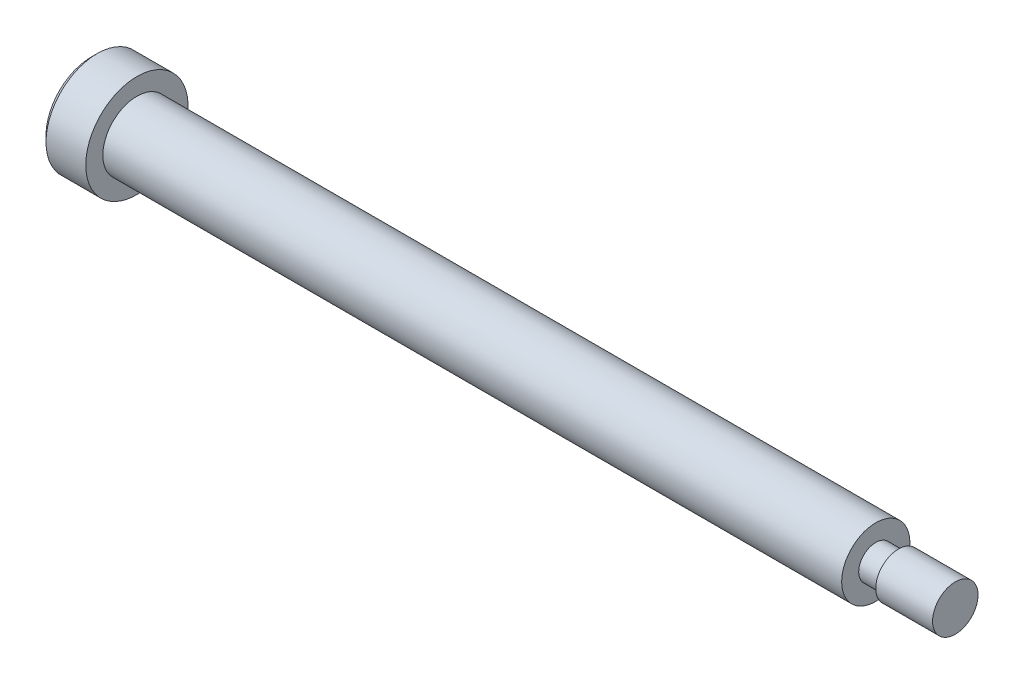
ISO-10303-21;
HEADER;
FILE_DESCRIPTION(('STEP AP214'),'2;1');
FILE_NAME('part.step','',(''),(''),'','','');
FILE_SCHEMA(('AUTOMOTIVE_DESIGN { 1 0 10303 214 1 1 1 1 }'));
ENDSEC;
DATA;
#1=APPLICATION_CONTEXT('core data for automotive mechanical design processes');
#2=APPLICATION_PROTOCOL_DEFINITION('international standard','automotive_design',2000,#1);
#3=PRODUCT_CONTEXT('',#1,'mechanical');
#4=PRODUCT('Part','Part','',(#3));
#5=PRODUCT_RELATED_PRODUCT_CATEGORY('part','',(#4));
#6=PRODUCT_DEFINITION_FORMATION('','',#4);
#7=PRODUCT_DEFINITION_CONTEXT('part definition',#1,'design');
#8=PRODUCT_DEFINITION('design','',#6,#7);
#9=PRODUCT_DEFINITION_SHAPE('','',#8);
#10=(LENGTH_UNIT() NAMED_UNIT(*) SI_UNIT(.MILLI.,.METRE.));
#11=(NAMED_UNIT(*) PLANE_ANGLE_UNIT() SI_UNIT($,.RADIAN.));
#12=(NAMED_UNIT(*) SI_UNIT($,.STERADIAN.) SOLID_ANGLE_UNIT());
#13=UNCERTAINTY_MEASURE_WITH_UNIT(LENGTH_MEASURE(1.E-05),#10,'distance_accuracy_value','');
#14=(GEOMETRIC_REPRESENTATION_CONTEXT(3) GLOBAL_UNCERTAINTY_ASSIGNED_CONTEXT((#13)) GLOBAL_UNIT_ASSIGNED_CONTEXT((#10,
#11,#12)) REPRESENTATION_CONTEXT('',''));
#15=CARTESIAN_POINT('',(0.,0.,0.));
#16=DIRECTION('',(0.,0.,1.));
#17=DIRECTION('',(1.,0.,0.));
#18=AXIS2_PLACEMENT_3D('',#15,#16,#17);
#19=CARTESIAN_POINT('',(0.,4.5,0.));
#20=DIRECTION('',(-1.,0.,0.));
#21=DIRECTION('',(0.,0.,1.));
#22=AXIS2_PLACEMENT_3D('',#19,#20,#21);
#23=PLANE('',#22);
#24=CARTESIAN_POINT('',(0.,0.,0.));
#25=DIRECTION('',(-1.,0.,0.));
#26=DIRECTION('',(0.,0.,1.));
#27=AXIS2_PLACEMENT_3D('',#24,#25,#26);
#28=CIRCLE('',#27,4.5);
#29=CARTESIAN_POINT('',(0.,0.,4.5));
#30=VERTEX_POINT('',#29);
#31=EDGE_CURVE('E158',#30,#30,#28,.T.);
#32=ORIENTED_EDGE('',*,*,#31,.F.);
#33=EDGE_LOOP('',(#32));
#34=FACE_BOUND('',#33,.T.);
#35=CARTESIAN_POINT('',(0.,0.,0.));
#36=DIRECTION('',(-1.,0.,0.));
#37=DIRECTION('',(0.,0.,1.));
#38=AXIS2_PLACEMENT_3D('',#35,#36,#37);
#39=CIRCLE('',#38,3.);
#40=CARTESIAN_POINT('',(0.,0.,3.));
#41=VERTEX_POINT('',#40);
#42=EDGE_CURVE('E135',#41,#41,#39,.T.);
#43=ORIENTED_EDGE('',*,*,#42,.T.);
#44=EDGE_LOOP('',(#43));
#45=FACE_BOUND('',#44,.T.);
#46=ADVANCED_FACE('F33',(#34,#45),#23,.F.);
#47=CARTESIAN_POINT('',(-15.4482466475727,0.,0.));
#48=DIRECTION('',(-1.,0.,0.));
#49=DIRECTION('',(0.,0.,1.));
#50=AXIS2_PLACEMENT_3D('',#47,#48,#49);
#51=CYLINDRICAL_SURFACE('',#50,4.5);
#52=CARTESIAN_POINT('',(-3.49999999999999,0.,0.));
#53=DIRECTION('',(1.,0.,0.));
#54=DIRECTION('',(0.,0.,-1.));
#55=AXIS2_PLACEMENT_3D('',#52,#53,#54);
#56=CIRCLE('',#55,4.5);
#57=CARTESIAN_POINT('',(-3.49999999999999,0.,-4.5));
#58=VERTEX_POINT('',#57);
#59=EDGE_CURVE('E11',#58,#58,#56,.T.);
#60=ORIENTED_EDGE('',*,*,#59,.T.);
#61=EDGE_LOOP('',(#60));
#62=FACE_BOUND('',#61,.T.);
#63=ORIENTED_EDGE('',*,*,#31,.T.);
#64=EDGE_LOOP('',(#63));
#65=FACE_BOUND('',#64,.T.);
#66=ADVANCED_FACE('F180',(#62,#65),#51,.T.);
#67=CARTESIAN_POINT('',(-4.,0.,0.));
#68=DIRECTION('',(1.,0.,0.));
#69=DIRECTION('',(0.,0.,-1.));
#70=AXIS2_PLACEMENT_3D('',#67,#68,#69);
#71=PLANE('',#70);
#72=DIRECTION('',(0.,-0.5,-0.866025403784439));
#73=VECTOR('',#72,1.);
#74=CARTESIAN_POINT('',(-4.,1.73205080756888,0.));
#75=LINE('',#74,#73);
#76=CARTESIAN_POINT('',(-4.,1.73205080756888,0.));
#77=VERTEX_POINT('',#76);
#78=CARTESIAN_POINT('',(-4.,0.866025403784438,-1.5));
#79=VERTEX_POINT('',#78);
#80=EDGE_CURVE('E122',#77,#79,#75,.T.);
#81=ORIENTED_EDGE('',*,*,#80,.F.);
#82=DIRECTION('',(0.,0.5,-0.866025403784439));
#83=VECTOR('',#82,1.);
#84=CARTESIAN_POINT('',(-4.,0.86602540378444,1.5));
#85=LINE('',#84,#83);
#86=CARTESIAN_POINT('',(-4.,0.86602540378444,1.5));
#87=VERTEX_POINT('',#86);
#88=EDGE_CURVE('E48',#87,#77,#85,.T.);
#89=ORIENTED_EDGE('',*,*,#88,.F.);
#90=DIRECTION('',(0.,1.,0.));
#91=VECTOR('',#90,1.);
#92=CARTESIAN_POINT('',(-4.,-0.866025403784439,1.5));
#93=LINE('',#92,#91);
#94=CARTESIAN_POINT('',(-4.,-0.866025403784439,1.5));
#95=VERTEX_POINT('',#94);
#96=EDGE_CURVE('E131',#95,#87,#93,.T.);
#97=ORIENTED_EDGE('',*,*,#96,.F.);
#98=DIRECTION('',(0.,0.5,0.866025403784438));
#99=VECTOR('',#98,1.);
#100=CARTESIAN_POINT('',(-4.,-1.73205080756888,0.));
#101=LINE('',#100,#99);
#102=CARTESIAN_POINT('',(-4.,-1.73205080756888,0.));
#103=VERTEX_POINT('',#102);
#104=EDGE_CURVE('E129',#103,#95,#101,.T.);
#105=ORIENTED_EDGE('',*,*,#104,.F.);
#106=DIRECTION('',(0.,-0.5,0.866025403784439));
#107=VECTOR('',#106,1.);
#108=CARTESIAN_POINT('',(-4.,-0.866025403784439,-1.5));
#109=LINE('',#108,#107);
#110=CARTESIAN_POINT('',(-4.,-0.866025403784439,-1.5));
#111=VERTEX_POINT('',#110);
#112=EDGE_CURVE('E96',#111,#103,#109,.T.);
#113=ORIENTED_EDGE('',*,*,#112,.F.);
#114=DIRECTION('',(0.,-1.,0.));
#115=VECTOR('',#114,1.);
#116=CARTESIAN_POINT('',(-4.,0.866025403784438,-1.5));
#117=LINE('',#116,#115);
#118=EDGE_CURVE('E125',#79,#111,#117,.T.);
#119=ORIENTED_EDGE('',*,*,#118,.F.);
#120=EDGE_LOOP('',(#81,#89,#97,#105,#113,#119));
#121=FACE_BOUND('',#120,.T.);
#122=CARTESIAN_POINT('',(-4.,0.,0.));
#123=DIRECTION('',(1.,0.,0.));
#124=DIRECTION('',(0.,0.,-1.));
#125=AXIS2_PLACEMENT_3D('',#122,#123,#124);
#126=CIRCLE('',#125,3.99999999999999);
#127=CARTESIAN_POINT('',(-4.,0.,-3.99999999999999));
#128=VERTEX_POINT('',#127);
#129=EDGE_CURVE('E41',#128,#128,#126,.F.);
#130=ORIENTED_EDGE('',*,*,#129,.T.);
#131=EDGE_LOOP('',(#130));
#132=FACE_BOUND('',#131,.T.);
#133=ADVANCED_FACE('F163',(#121,#132),#71,.F.);
#134=CARTESIAN_POINT('',(72.,2.,0.));
#135=DIRECTION('',(-1.,0.,0.));
#136=DIRECTION('',(0.,0.,1.));
#137=AXIS2_PLACEMENT_3D('',#134,#135,#136);
#138=PLANE('',#137);
#139=CARTESIAN_POINT('',(72.,0.,0.));
#140=DIRECTION('',(-1.,0.,0.));
#141=DIRECTION('',(0.,0.,1.));
#142=AXIS2_PLACEMENT_3D('',#139,#140,#141);
#143=CIRCLE('',#142,2.);
#144=CARTESIAN_POINT('',(72.,0.,2.));
#145=VERTEX_POINT('',#144);
#146=EDGE_CURVE('E155',#145,#145,#143,.T.);
#147=ORIENTED_EDGE('',*,*,#146,.F.);
#148=EDGE_LOOP('',(#147));
#149=FACE_BOUND('',#148,.T.);
#150=ADVANCED_FACE('F192',(#149),#138,.F.);
#151=CARTESIAN_POINT('',(-15.4482466475727,0.,0.));
#152=DIRECTION('',(-1.,0.,0.));
#153=DIRECTION('',(0.,0.,1.));
#154=AXIS2_PLACEMENT_3D('',#151,#152,#153);
#155=CYLINDRICAL_SURFACE('',#154,2.);
#156=CARTESIAN_POINT('',(67.,0.,0.));
#157=DIRECTION('',(-1.,0.,0.));
#158=DIRECTION('',(0.,0.,1.));
#159=AXIS2_PLACEMENT_3D('',#156,#157,#158);
#160=CIRCLE('',#159,2.);
#161=CARTESIAN_POINT('',(67.,0.,2.));
#162=VERTEX_POINT('',#161);
#163=EDGE_CURVE('E152',#162,#162,#160,.T.);
#164=ORIENTED_EDGE('',*,*,#163,.F.);
#165=EDGE_LOOP('',(#164));
#166=FACE_BOUND('',#165,.T.);
#167=ORIENTED_EDGE('',*,*,#146,.T.);
#168=EDGE_LOOP('',(#167));
#169=FACE_BOUND('',#168,.T.);
#170=ADVANCED_FACE('F196',(#166,#169),#155,.T.);
#171=CARTESIAN_POINT('',(67.,1.5,0.));
#172=DIRECTION('',(1.,0.,0.));
#173=DIRECTION('',(0.,0.,-1.));
#174=AXIS2_PLACEMENT_3D('',#171,#172,#173);
#175=PLANE('',#174);
#176=CARTESIAN_POINT('',(67.,0.,0.));
#177=DIRECTION('',(-1.,0.,0.));
#178=DIRECTION('',(0.,0.,1.));
#179=AXIS2_PLACEMENT_3D('',#176,#177,#178);
#180=CIRCLE('',#179,1.5);
#181=CARTESIAN_POINT('',(67.,0.,1.5));
#182=VERTEX_POINT('',#181);
#183=EDGE_CURVE('E149',#182,#182,#180,.T.);
#184=ORIENTED_EDGE('',*,*,#183,.F.);
#185=EDGE_LOOP('',(#184));
#186=FACE_BOUND('',#185,.T.);
#187=ORIENTED_EDGE('',*,*,#163,.T.);
#188=EDGE_LOOP('',(#187));
#189=FACE_BOUND('',#188,.T.);
#190=ADVANCED_FACE('F200',(#186,#189),#175,.F.);
#191=CARTESIAN_POINT('',(-15.4482466475727,0.,0.));
#192=DIRECTION('',(-1.,0.,0.));
#193=DIRECTION('',(0.,0.,1.));
#194=AXIS2_PLACEMENT_3D('',#191,#192,#193);
#195=CYLINDRICAL_SURFACE('',#194,1.5);
#196=CARTESIAN_POINT('',(65.,0.,0.));
#197=DIRECTION('',(-1.,0.,0.));
#198=DIRECTION('',(0.,0.,1.));
#199=AXIS2_PLACEMENT_3D('',#196,#197,#198);
#200=CIRCLE('',#199,1.5);
#201=CARTESIAN_POINT('',(65.,0.,1.5));
#202=VERTEX_POINT('',#201);
#203=EDGE_CURVE('E146',#202,#202,#200,.T.);
#204=ORIENTED_EDGE('',*,*,#203,.F.);
#205=EDGE_LOOP('',(#204));
#206=FACE_BOUND('',#205,.T.);
#207=ORIENTED_EDGE('',*,*,#183,.T.);
#208=EDGE_LOOP('',(#207));
#209=FACE_BOUND('',#208,.T.);
#210=ADVANCED_FACE('F204',(#206,#209),#195,.T.);
#211=CARTESIAN_POINT('',(65.,3.,0.));
#212=DIRECTION('',(-1.,0.,0.));
#213=DIRECTION('',(0.,0.,1.));
#214=AXIS2_PLACEMENT_3D('',#211,#212,#213);
#215=PLANE('',#214);
#216=CARTESIAN_POINT('',(65.,0.,0.));
#217=DIRECTION('',(-1.,0.,0.));
#218=DIRECTION('',(0.,0.,1.));
#219=AXIS2_PLACEMENT_3D('',#216,#217,#218);
#220=CIRCLE('',#219,3.);
#221=CARTESIAN_POINT('',(65.,0.,3.));
#222=VERTEX_POINT('',#221);
#223=EDGE_CURVE('E143',#222,#222,#220,.T.);
#224=ORIENTED_EDGE('',*,*,#223,.F.);
#225=EDGE_LOOP('',(#224));
#226=FACE_BOUND('',#225,.T.);
#227=ORIENTED_EDGE('',*,*,#203,.T.);
#228=EDGE_LOOP('',(#227));
#229=FACE_BOUND('',#228,.T.);
#230=ADVANCED_FACE('F175',(#226,#229),#215,.F.);
#231=CARTESIAN_POINT('',(-15.4482466475727,0.,0.));
#232=DIRECTION('',(-1.,0.,0.));
#233=DIRECTION('',(0.,0.,1.));
#234=AXIS2_PLACEMENT_3D('',#231,#232,#233);
#235=CYLINDRICAL_SURFACE('',#234,3.);
#236=ORIENTED_EDGE('',*,*,#42,.F.);
#237=EDGE_LOOP('',(#236));
#238=FACE_BOUND('',#237,.T.);
#239=ORIENTED_EDGE('',*,*,#223,.T.);
#240=EDGE_LOOP('',(#239));
#241=FACE_BOUND('',#240,.T.);
#242=ADVANCED_FACE('F167',(#238,#241),#235,.T.);
#243=CARTESIAN_POINT('',(-4.,0.,0.));
#244=DIRECTION('',(1.,0.,0.));
#245=DIRECTION('',(0.,0.,-1.));
#246=AXIS2_PLACEMENT_3D('',#243,#244,#245);
#247=CONICAL_SURFACE('',#246,3.99999999999999,0.785398163397447);
#248=ORIENTED_EDGE('',*,*,#59,.F.);
#249=EDGE_LOOP('',(#248));
#250=FACE_BOUND('',#249,.T.);
#251=ORIENTED_EDGE('',*,*,#129,.F.);
#252=EDGE_LOOP('',(#251));
#253=FACE_BOUND('',#252,.T.);
#254=ADVANCED_FACE('F35',(#250,#253),#247,.T.);
#255=CARTESIAN_POINT('',(-2.,0.86602540378444,1.5));
#256=DIRECTION('',(0.,0.866025403784439,0.5));
#257=DIRECTION('',(0.,-0.5,0.866025403784439));
#258=AXIS2_PLACEMENT_3D('',#255,#256,#257);
#259=PLANE('',#258);
#260=ORIENTED_EDGE('',*,*,#88,.T.);
#261=DIRECTION('',(-1.,0.,0.));
#262=VECTOR('',#261,1.);
#263=CARTESIAN_POINT('',(-2.,1.73205080756888,0.));
#264=LINE('',#263,#262);
#265=CARTESIAN_POINT('',(-2.,1.73205080756888,0.));
#266=VERTEX_POINT('',#265);
#267=EDGE_CURVE('E78',#266,#77,#264,.T.);
#268=ORIENTED_EDGE('',*,*,#267,.F.);
#269=DIRECTION('',(0.,0.5,-0.866025403784439));
#270=VECTOR('',#269,1.);
#271=CARTESIAN_POINT('',(-2.,0.86602540378444,1.5));
#272=LINE('',#271,#270);
#273=CARTESIAN_POINT('',(-2.,0.86602540378444,1.5));
#274=VERTEX_POINT('',#273);
#275=EDGE_CURVE('E133',#274,#266,#272,.T.);
#276=ORIENTED_EDGE('',*,*,#275,.F.);
#277=DIRECTION('',(-1.,0.,0.));
#278=VECTOR('',#277,1.);
#279=CARTESIAN_POINT('',(-2.,0.86602540378444,1.5));
#280=LINE('',#279,#278);
#281=EDGE_CURVE('E56',#274,#87,#280,.T.);
#282=ORIENTED_EDGE('',*,*,#281,.T.);
#283=EDGE_LOOP('',(#260,#268,#276,#282));
#284=FACE_BOUND('',#283,.T.);
#285=ADVANCED_FACE('F166',(#284),#259,.F.);
#286=CARTESIAN_POINT('',(-2.,-0.866025403784439,1.5));
#287=DIRECTION('',(0.,0.,1.));
#288=DIRECTION('',(0.,-1.,0.));
#289=AXIS2_PLACEMENT_3D('',#286,#287,#288);
#290=PLANE('',#289);
#291=ORIENTED_EDGE('',*,*,#96,.T.);
#292=ORIENTED_EDGE('',*,*,#281,.F.);
#293=DIRECTION('',(0.,1.,0.));
#294=VECTOR('',#293,1.);
#295=CARTESIAN_POINT('',(-2.,-0.866025403784439,1.5));
#296=LINE('',#295,#294);
#297=CARTESIAN_POINT('',(-2.,-0.866025403784439,1.5));
#298=VERTEX_POINT('',#297);
#299=EDGE_CURVE('E108',#298,#274,#296,.T.);
#300=ORIENTED_EDGE('',*,*,#299,.F.);
#301=DIRECTION('',(-1.,0.,0.));
#302=VECTOR('',#301,1.);
#303=CARTESIAN_POINT('',(-2.,-0.866025403784439,1.5));
#304=LINE('',#303,#302);
#305=EDGE_CURVE('E100',#298,#95,#304,.T.);
#306=ORIENTED_EDGE('',*,*,#305,.T.);
#307=EDGE_LOOP('',(#291,#292,#300,#306));
#308=FACE_BOUND('',#307,.T.);
#309=ADVANCED_FACE('F173',(#308),#290,.F.);
#310=CARTESIAN_POINT('',(-2.,-1.73205080756888,0.));
#311=DIRECTION('',(0.,-0.866025403784439,0.5));
#312=DIRECTION('',(0.,-0.5,-0.866025403784439));
#313=AXIS2_PLACEMENT_3D('',#310,#311,#312);
#314=PLANE('',#313);
#315=ORIENTED_EDGE('',*,*,#104,.T.);
#316=ORIENTED_EDGE('',*,*,#305,.F.);
#317=DIRECTION('',(0.,0.5,0.866025403784438));
#318=VECTOR('',#317,1.);
#319=CARTESIAN_POINT('',(-2.,-1.73205080756888,0.));
#320=LINE('',#319,#318);
#321=CARTESIAN_POINT('',(-2.,-1.73205080756888,0.));
#322=VERTEX_POINT('',#321);
#323=EDGE_CURVE('E104',#322,#298,#320,.T.);
#324=ORIENTED_EDGE('',*,*,#323,.F.);
#325=DIRECTION('',(-1.,0.,0.));
#326=VECTOR('',#325,1.);
#327=CARTESIAN_POINT('',(-2.,-1.73205080756888,0.));
#328=LINE('',#327,#326);
#329=EDGE_CURVE('E89',#322,#103,#328,.T.);
#330=ORIENTED_EDGE('',*,*,#329,.T.);
#331=EDGE_LOOP('',(#315,#316,#324,#330));
#332=FACE_BOUND('',#331,.T.);
#333=ADVANCED_FACE('F105',(#332),#314,.F.);
#334=CARTESIAN_POINT('',(-2.,-0.866025403784439,-1.5));
#335=DIRECTION('',(0.,-0.866025403784439,-0.5));
#336=DIRECTION('',(0.,0.5,-0.866025403784439));
#337=AXIS2_PLACEMENT_3D('',#334,#335,#336);
#338=PLANE('',#337);
#339=ORIENTED_EDGE('',*,*,#112,.T.);
#340=ORIENTED_EDGE('',*,*,#329,.F.);
#341=DIRECTION('',(0.,-0.5,0.866025403784439));
#342=VECTOR('',#341,1.);
#343=CARTESIAN_POINT('',(-2.,-0.866025403784439,-1.5));
#344=LINE('',#343,#342);
#345=CARTESIAN_POINT('',(-2.,-0.866025403784439,-1.5));
#346=VERTEX_POINT('',#345);
#347=EDGE_CURVE('E93',#346,#322,#344,.T.);
#348=ORIENTED_EDGE('',*,*,#347,.F.);
#349=DIRECTION('',(-1.,0.,0.));
#350=VECTOR('',#349,1.);
#351=CARTESIAN_POINT('',(-2.,-0.866025403784439,-1.5));
#352=LINE('',#351,#350);
#353=EDGE_CURVE('E101',#346,#111,#352,.T.);
#354=ORIENTED_EDGE('',*,*,#353,.T.);
#355=EDGE_LOOP('',(#339,#340,#348,#354));
#356=FACE_BOUND('',#355,.T.);
#357=ADVANCED_FACE('F91',(#356),#338,.F.);
#358=CARTESIAN_POINT('',(-2.,0.866025403784438,-1.5));
#359=DIRECTION('',(0.,0.,-1.));
#360=DIRECTION('',(0.,1.,0.));
#361=AXIS2_PLACEMENT_3D('',#358,#359,#360);
#362=PLANE('',#361);
#363=ORIENTED_EDGE('',*,*,#118,.T.);
#364=ORIENTED_EDGE('',*,*,#353,.F.);
#365=DIRECTION('',(0.,-1.,0.));
#366=VECTOR('',#365,1.);
#367=CARTESIAN_POINT('',(-2.,0.866025403784438,-1.5));
#368=LINE('',#367,#366);
#369=CARTESIAN_POINT('',(-2.,0.866025403784438,-1.5));
#370=VERTEX_POINT('',#369);
#371=EDGE_CURVE('E114',#370,#346,#368,.T.);
#372=ORIENTED_EDGE('',*,*,#371,.F.);
#373=DIRECTION('',(-1.,0.,0.));
#374=VECTOR('',#373,1.);
#375=CARTESIAN_POINT('',(-2.,0.866025403784438,-1.5));
#376=LINE('',#375,#374);
#377=EDGE_CURVE('E138',#370,#79,#376,.T.);
#378=ORIENTED_EDGE('',*,*,#377,.T.);
#379=EDGE_LOOP('',(#363,#364,#372,#378));
#380=FACE_BOUND('',#379,.T.);
#381=ADVANCED_FACE('F215',(#380),#362,.F.);
#382=CARTESIAN_POINT('',(-2.,1.73205080756888,0.));
#383=DIRECTION('',(0.,0.866025403784439,-0.5));
#384=DIRECTION('',(0.,0.5,0.866025403784439));
#385=AXIS2_PLACEMENT_3D('',#382,#383,#384);
#386=PLANE('',#385);
#387=ORIENTED_EDGE('',*,*,#80,.T.);
#388=ORIENTED_EDGE('',*,*,#377,.F.);
#389=DIRECTION('',(0.,-0.5,-0.866025403784439));
#390=VECTOR('',#389,1.);
#391=CARTESIAN_POINT('',(-2.,1.73205080756888,0.));
#392=LINE('',#391,#390);
#393=EDGE_CURVE('E116',#266,#370,#392,.T.);
#394=ORIENTED_EDGE('',*,*,#393,.F.);
#395=ORIENTED_EDGE('',*,*,#267,.T.);
#396=EDGE_LOOP('',(#387,#388,#394,#395));
#397=FACE_BOUND('',#396,.T.);
#398=ADVANCED_FACE('F212',(#397),#386,.F.);
#399=CARTESIAN_POINT('',(-2.,1.73205080756888,0.));
#400=DIRECTION('',(-1.,0.,0.));
#401=DIRECTION('',(0.,0.,1.));
#402=AXIS2_PLACEMENT_3D('',#399,#400,#401);
#403=PLANE('',#402);
#404=ORIENTED_EDGE('',*,*,#275,.T.);
#405=ORIENTED_EDGE('',*,*,#393,.T.);
#406=ORIENTED_EDGE('',*,*,#371,.T.);
#407=ORIENTED_EDGE('',*,*,#347,.T.);
#408=ORIENTED_EDGE('',*,*,#323,.T.);
#409=ORIENTED_EDGE('',*,*,#299,.T.);
#410=EDGE_LOOP('',(#404,#405,#406,#407,#408,#409));
#411=FACE_BOUND('',#410,.T.);
#412=ADVANCED_FACE('F111',(#411),#403,.T.);
#413=CLOSED_SHELL('',(#46,#66,#133,#150,#170,#190,#210,#230,#242,#254,#285,#309,#333,#357,#381,
#398,#412));
#414=MANIFOLD_SOLID_BREP('B2',#413);
#415=ADVANCED_BREP_SHAPE_REPRESENTATION('',(#18,#414),#14);
#416=SHAPE_DEFINITION_REPRESENTATION(#9,#415);
ENDSEC;
END-ISO-10303-21;
